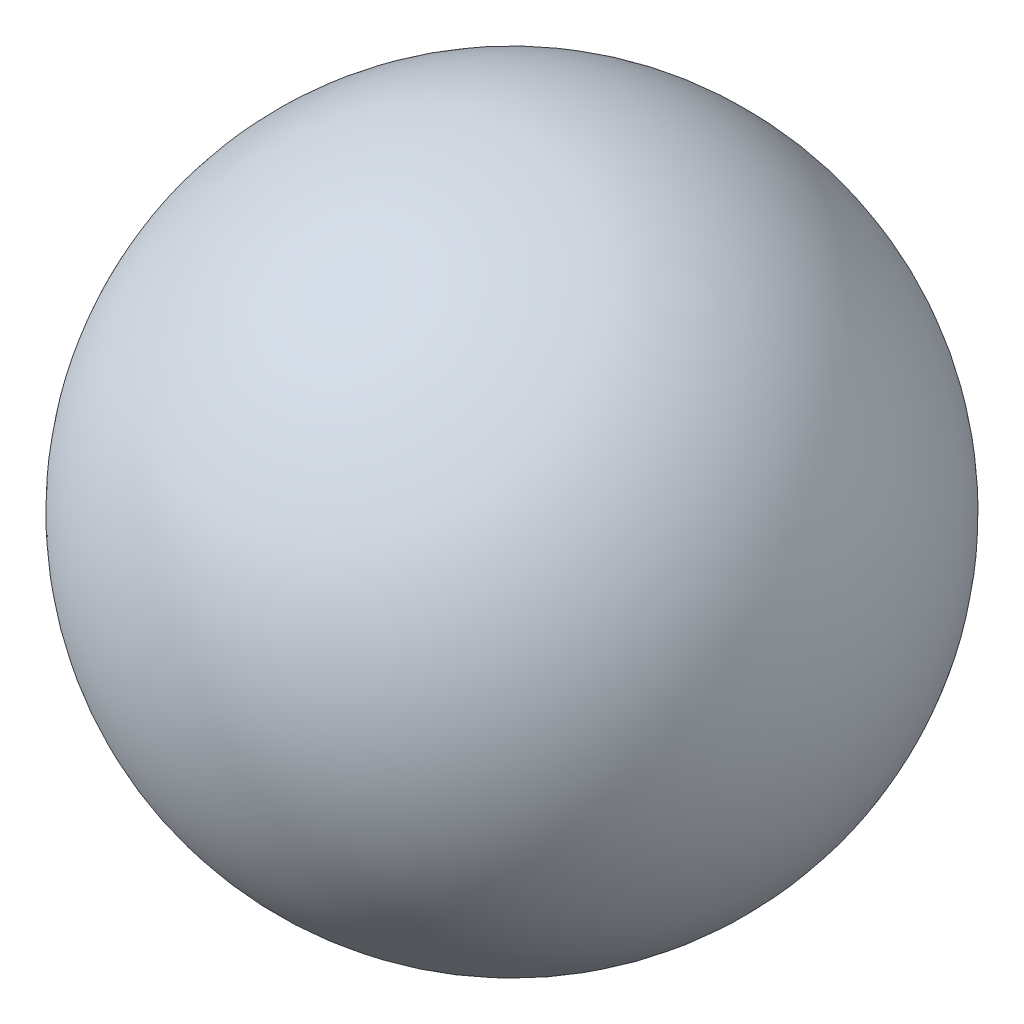
ISO-10303-21;
HEADER;
FILE_DESCRIPTION(('STEP AP214'),'2;1');
FILE_NAME('part.step','',(''),(''),'','','');
FILE_SCHEMA(('AUTOMOTIVE_DESIGN { 1 0 10303 214 1 1 1 1 }'));
ENDSEC;
DATA;
#1=APPLICATION_CONTEXT('core data for automotive mechanical design processes');
#2=APPLICATION_PROTOCOL_DEFINITION('international standard','automotive_design',2000,#1);
#3=PRODUCT_CONTEXT('',#1,'mechanical');
#4=PRODUCT('Part','Part','',(#3));
#5=PRODUCT_RELATED_PRODUCT_CATEGORY('part','',(#4));
#6=PRODUCT_DEFINITION_FORMATION('','',#4);
#7=PRODUCT_DEFINITION_CONTEXT('part definition',#1,'design');
#8=PRODUCT_DEFINITION('design','',#6,#7);
#9=PRODUCT_DEFINITION_SHAPE('','',#8);
#10=(LENGTH_UNIT() NAMED_UNIT(*) SI_UNIT(.MILLI.,.METRE.));
#11=(NAMED_UNIT(*) PLANE_ANGLE_UNIT() SI_UNIT($,.RADIAN.));
#12=(NAMED_UNIT(*) SI_UNIT($,.STERADIAN.) SOLID_ANGLE_UNIT());
#13=UNCERTAINTY_MEASURE_WITH_UNIT(LENGTH_MEASURE(1.E-05),#10,'distance_accuracy_value','');
#14=(GEOMETRIC_REPRESENTATION_CONTEXT(3) GLOBAL_UNCERTAINTY_ASSIGNED_CONTEXT((#13)) GLOBAL_UNIT_ASSIGNED_CONTEXT((#10,
#11,#12)) REPRESENTATION_CONTEXT('',''));
#15=CARTESIAN_POINT('',(0.,0.,0.));
#16=DIRECTION('',(0.,0.,1.));
#17=DIRECTION('',(1.,0.,0.));
#18=AXIS2_PLACEMENT_3D('',#15,#16,#17);
#19=CARTESIAN_POINT('',(0.,0.,0.));
#20=DIRECTION('',(-1.,0.,0.));
#21=DIRECTION('',(0.,1.,0.));
#22=AXIS2_PLACEMENT_3D('',#19,#20,#21);
#23=SPHERICAL_SURFACE('',#22,0.6);
#24=CARTESIAN_POINT('',(-0.6,0.,0.));
#25=VERTEX_POINT('',#24);
#26=VERTEX_LOOP('',#25);
#27=FACE_BOUND('',#26,.T.);
#28=ADVANCED_FACE('F31',(#27),#23,.T.);
#29=CLOSED_SHELL('',(#28));
#30=MANIFOLD_SOLID_BREP('B2',#29);
#31=ADVANCED_BREP_SHAPE_REPRESENTATION('',(#18,#30),#14);
#32=SHAPE_DEFINITION_REPRESENTATION(#9,#31);
ENDSEC;
END-ISO-10303-21;
